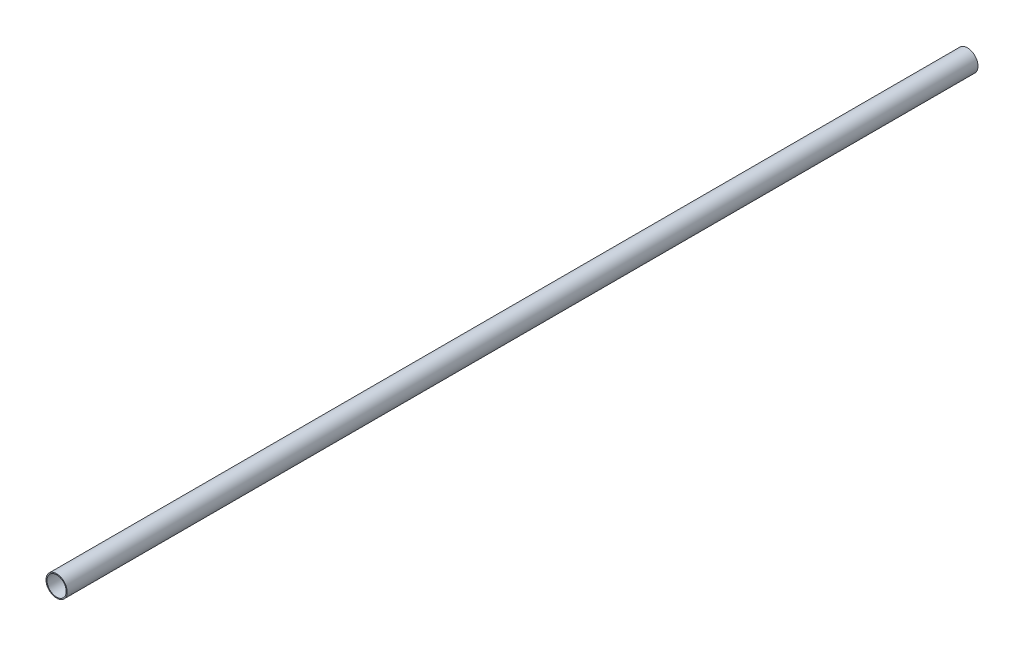
ISO-10303-21;
HEADER;
FILE_DESCRIPTION(('STEP AP214'),'2;1');
FILE_NAME('part.step','',(''),(''),'','','');
FILE_SCHEMA(('AUTOMOTIVE_DESIGN { 1 0 10303 214 1 1 1 1 }'));
ENDSEC;
DATA;
#1=APPLICATION_CONTEXT('core data for automotive mechanical design processes');
#2=APPLICATION_PROTOCOL_DEFINITION('international standard','automotive_design',2000,#1);
#3=PRODUCT_CONTEXT('',#1,'mechanical');
#4=PRODUCT('Part','Part','',(#3));
#5=PRODUCT_RELATED_PRODUCT_CATEGORY('part','',(#4));
#6=PRODUCT_DEFINITION_FORMATION('','',#4);
#7=PRODUCT_DEFINITION_CONTEXT('part definition',#1,'design');
#8=PRODUCT_DEFINITION('design','',#6,#7);
#9=PRODUCT_DEFINITION_SHAPE('','',#8);
#10=(LENGTH_UNIT() NAMED_UNIT(*) SI_UNIT(.MILLI.,.METRE.));
#11=(NAMED_UNIT(*) PLANE_ANGLE_UNIT() SI_UNIT($,.RADIAN.));
#12=(NAMED_UNIT(*) SI_UNIT($,.STERADIAN.) SOLID_ANGLE_UNIT());
#13=UNCERTAINTY_MEASURE_WITH_UNIT(LENGTH_MEASURE(1.E-05),#10,'distance_accuracy_value','');
#14=(GEOMETRIC_REPRESENTATION_CONTEXT(3) GLOBAL_UNCERTAINTY_ASSIGNED_CONTEXT((#13)) GLOBAL_UNIT_ASSIGNED_CONTEXT((#10,
#11,#12)) REPRESENTATION_CONTEXT('',''));
#15=CARTESIAN_POINT('',(0.,0.,0.));
#16=DIRECTION('',(0.,0.,1.));
#17=DIRECTION('',(1.,0.,0.));
#18=AXIS2_PLACEMENT_3D('',#15,#16,#17);
#19=CARTESIAN_POINT('',(0.,0.,944.));
#20=DIRECTION('',(0.,0.,1.));
#21=DIRECTION('',(1.,0.,0.));
#22=AXIS2_PLACEMENT_3D('',#19,#20,#21);
#23=PLANE('',#22);
#24=CARTESIAN_POINT('',(0.,0.,944.));
#25=DIRECTION('',(0.,0.,1.));
#26=DIRECTION('',(1.,0.,0.));
#27=AXIS2_PLACEMENT_3D('',#24,#25,#26);
#28=CIRCLE('',#27,11.);
#29=CARTESIAN_POINT('',(11.,0.,944.));
#30=VERTEX_POINT('',#29);
#31=EDGE_CURVE('E10',#30,#30,#28,.T.);
#32=ORIENTED_EDGE('',*,*,#31,.T.);
#33=EDGE_LOOP('',(#32));
#34=FACE_BOUND('',#33,.T.);
#35=CARTESIAN_POINT('',(0.,0.,944.));
#36=DIRECTION('',(0.,0.,1.));
#37=DIRECTION('',(1.,0.,0.));
#38=AXIS2_PLACEMENT_3D('',#35,#36,#37);
#39=CIRCLE('',#38,10.);
#40=CARTESIAN_POINT('',(10.,0.,944.));
#41=VERTEX_POINT('',#40);
#42=EDGE_CURVE('E50',#41,#41,#39,.T.);
#43=ORIENTED_EDGE('',*,*,#42,.F.);
#44=EDGE_LOOP('',(#43));
#45=FACE_BOUND('',#44,.T.);
#46=ADVANCED_FACE('F39',(#34,#45),#23,.T.);
#47=CARTESIAN_POINT('',(0.,0.,0.));
#48=DIRECTION('',(0.,0.,1.));
#49=DIRECTION('',(1.,0.,0.));
#50=AXIS2_PLACEMENT_3D('',#47,#48,#49);
#51=PLANE('',#50);
#52=CARTESIAN_POINT('',(0.,0.,0.));
#53=DIRECTION('',(0.,0.,1.));
#54=DIRECTION('',(1.,0.,0.));
#55=AXIS2_PLACEMENT_3D('',#52,#53,#54);
#56=CIRCLE('',#55,11.);
#57=CARTESIAN_POINT('',(11.,0.,0.));
#58=VERTEX_POINT('',#57);
#59=EDGE_CURVE('E43',#58,#58,#56,.T.);
#60=ORIENTED_EDGE('',*,*,#59,.F.);
#61=EDGE_LOOP('',(#60));
#62=FACE_BOUND('',#61,.T.);
#63=CARTESIAN_POINT('',(0.,0.,0.));
#64=DIRECTION('',(0.,0.,1.));
#65=DIRECTION('',(1.,0.,0.));
#66=AXIS2_PLACEMENT_3D('',#63,#64,#65);
#67=CIRCLE('',#66,10.);
#68=CARTESIAN_POINT('',(10.,0.,0.));
#69=VERTEX_POINT('',#68);
#70=EDGE_CURVE('E52',#69,#69,#67,.T.);
#71=ORIENTED_EDGE('',*,*,#70,.T.);
#72=EDGE_LOOP('',(#71));
#73=FACE_BOUND('',#72,.T.);
#74=ADVANCED_FACE('F62',(#62,#73),#51,.F.);
#75=CARTESIAN_POINT('',(0.,0.,944.));
#76=DIRECTION('',(0.,0.,-1.));
#77=DIRECTION('',(-1.,0.,0.));
#78=AXIS2_PLACEMENT_3D('',#75,#76,#77);
#79=CYLINDRICAL_SURFACE('',#78,11.);
#80=ORIENTED_EDGE('',*,*,#31,.F.);
#81=EDGE_LOOP('',(#80));
#82=FACE_BOUND('',#81,.T.);
#83=ORIENTED_EDGE('',*,*,#59,.T.);
#84=EDGE_LOOP('',(#83));
#85=FACE_BOUND('',#84,.T.);
#86=ADVANCED_FACE('F41',(#82,#85),#79,.T.);
#87=CARTESIAN_POINT('',(0.,0.,944.));
#88=DIRECTION('',(0.,0.,-1.));
#89=DIRECTION('',(-1.,0.,0.));
#90=AXIS2_PLACEMENT_3D('',#87,#88,#89);
#91=CYLINDRICAL_SURFACE('',#90,10.);
#92=ORIENTED_EDGE('',*,*,#42,.T.);
#93=EDGE_LOOP('',(#92));
#94=FACE_BOUND('',#93,.T.);
#95=ORIENTED_EDGE('',*,*,#70,.F.);
#96=EDGE_LOOP('',(#95));
#97=FACE_BOUND('',#96,.T.);
#98=ADVANCED_FACE('F58',(#94,#97),#91,.F.);
#99=CLOSED_SHELL('',(#46,#74,#86,#98));
#100=MANIFOLD_SOLID_BREP('B2',#99);
#101=ADVANCED_BREP_SHAPE_REPRESENTATION('',(#18,#100),#14);
#102=SHAPE_DEFINITION_REPRESENTATION(#9,#101);
ENDSEC;
END-ISO-10303-21;
